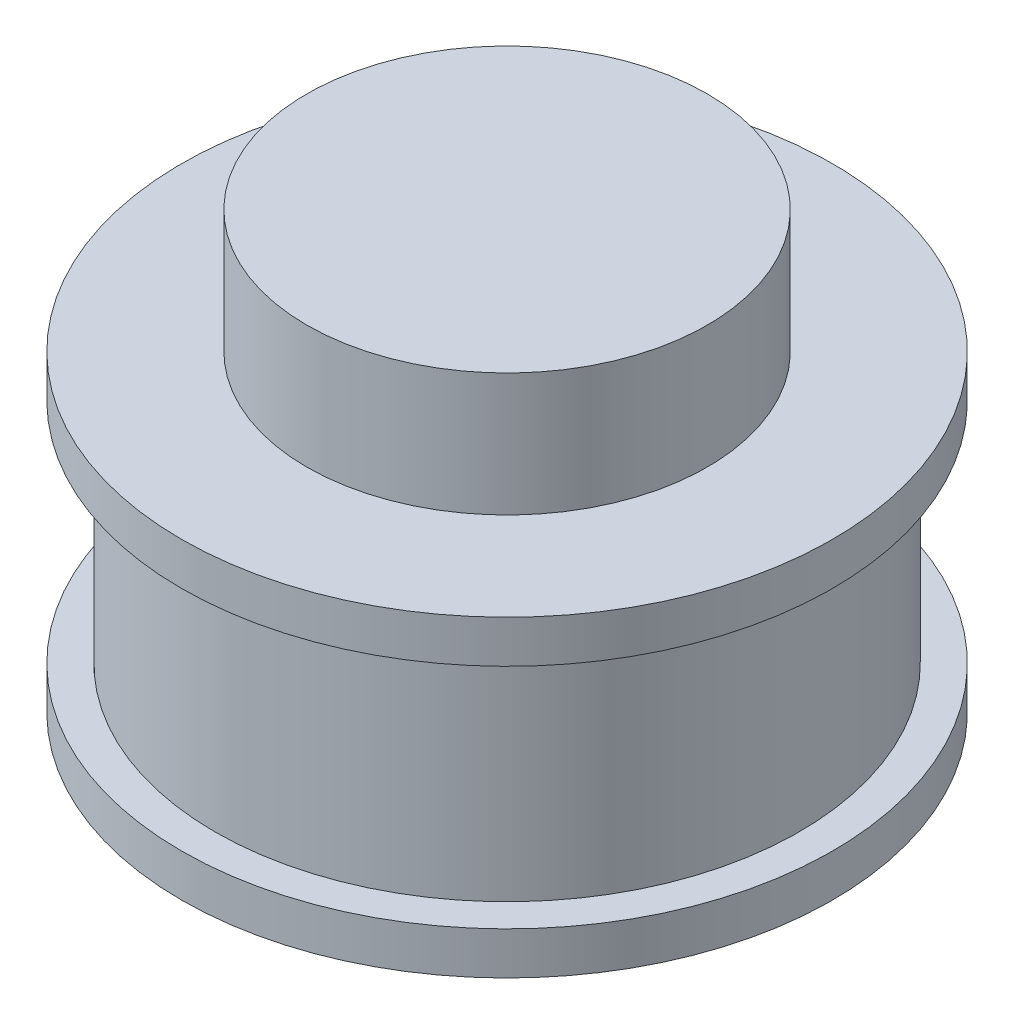
ISO-10303-21;
HEADER;
FILE_DESCRIPTION(('STEP AP214'),'2;1');
FILE_NAME('part.step','',(''),(''),'','','');
FILE_SCHEMA(('AUTOMOTIVE_DESIGN { 1 0 10303 214 1 1 1 1 }'));
ENDSEC;
DATA;
#1=APPLICATION_CONTEXT('core data for automotive mechanical design processes');
#2=APPLICATION_PROTOCOL_DEFINITION('international standard','automotive_design',2000,#1);
#3=PRODUCT_CONTEXT('',#1,'mechanical');
#4=PRODUCT('Part','Part','',(#3));
#5=PRODUCT_RELATED_PRODUCT_CATEGORY('part','',(#4));
#6=PRODUCT_DEFINITION_FORMATION('','',#4);
#7=PRODUCT_DEFINITION_CONTEXT('part definition',#1,'design');
#8=PRODUCT_DEFINITION('design','',#6,#7);
#9=PRODUCT_DEFINITION_SHAPE('','',#8);
#10=(LENGTH_UNIT() NAMED_UNIT(*) SI_UNIT(.MILLI.,.METRE.));
#11=(NAMED_UNIT(*) PLANE_ANGLE_UNIT() SI_UNIT($,.RADIAN.));
#12=(NAMED_UNIT(*) SI_UNIT($,.STERADIAN.) SOLID_ANGLE_UNIT());
#13=UNCERTAINTY_MEASURE_WITH_UNIT(LENGTH_MEASURE(1.E-05),#10,'distance_accuracy_value','');
#14=(GEOMETRIC_REPRESENTATION_CONTEXT(3) GLOBAL_UNCERTAINTY_ASSIGNED_CONTEXT((#13)) GLOBAL_UNIT_ASSIGNED_CONTEXT((#10,
#11,#12)) REPRESENTATION_CONTEXT('',''));
#15=CARTESIAN_POINT('',(0.,0.,0.));
#16=DIRECTION('',(0.,0.,1.));
#17=DIRECTION('',(1.,0.,0.));
#18=AXIS2_PLACEMENT_3D('',#15,#16,#17);
#19=CARTESIAN_POINT('',(0.,0.,0.));
#20=DIRECTION('',(0.,1.,0.));
#21=DIRECTION('',(0.,0.,1.));
#22=AXIS2_PLACEMENT_3D('',#19,#20,#21);
#23=PLANE('',#22);
#24=CARTESIAN_POINT('',(0.,0.,0.));
#25=DIRECTION('',(0.,1.,0.));
#26=DIRECTION('',(0.,0.,1.));
#27=AXIS2_PLACEMENT_3D('',#24,#25,#26);
#28=CIRCLE('',#27,20.6375);
#29=CARTESIAN_POINT('',(0.,0.,20.6375));
#30=VERTEX_POINT('',#29);
#31=EDGE_CURVE('E10',#30,#30,#28,.T.);
#32=ORIENTED_EDGE('',*,*,#31,.F.);
#33=EDGE_LOOP('',(#32));
#34=FACE_BOUND('',#33,.T.);
#35=ADVANCED_FACE('F31',(#34),#23,.F.);
#36=CARTESIAN_POINT('',(0.,27.6098,0.));
#37=DIRECTION('',(0.,1.,0.));
#38=DIRECTION('',(0.,0.,1.));
#39=AXIS2_PLACEMENT_3D('',#36,#37,#38);
#40=CYLINDRICAL_SURFACE('',#39,20.6375);
#41=CARTESIAN_POINT('',(0.,2.69732332820154,0.));
#42=DIRECTION('',(0.,1.,0.));
#43=DIRECTION('',(0.,0.,1.));
#44=AXIS2_PLACEMENT_3D('',#41,#42,#43);
#45=CIRCLE('',#44,20.6375);
#46=CARTESIAN_POINT('',(0.,2.69732332820154,20.6375));
#47=VERTEX_POINT('',#46);
#48=EDGE_CURVE('E37',#47,#47,#45,.T.);
#49=ORIENTED_EDGE('',*,*,#48,.F.);
#50=EDGE_LOOP('',(#49));
#51=FACE_BOUND('',#50,.T.);
#52=ORIENTED_EDGE('',*,*,#31,.T.);
#53=EDGE_LOOP('',(#52));
#54=FACE_BOUND('',#53,.T.);
#55=ADVANCED_FACE('F97',(#51,#54),#40,.T.);
#56=CARTESIAN_POINT('',(18.5293,2.69732332820154,0.));
#57=DIRECTION('',(0.,-1.,0.));
#58=DIRECTION('',(0.,0.,-1.));
#59=AXIS2_PLACEMENT_3D('',#56,#57,#58);
#60=PLANE('',#59);
#61=CARTESIAN_POINT('',(0.,2.69732332820154,0.));
#62=DIRECTION('',(0.,1.,0.));
#63=DIRECTION('',(0.,0.,1.));
#64=AXIS2_PLACEMENT_3D('',#61,#62,#63);
#65=CIRCLE('',#64,18.5293);
#66=CARTESIAN_POINT('',(0.,2.69732332820154,18.5293));
#67=VERTEX_POINT('',#66);
#68=EDGE_CURVE('E41',#67,#67,#65,.T.);
#69=ORIENTED_EDGE('',*,*,#68,.F.);
#70=EDGE_LOOP('',(#69));
#71=FACE_BOUND('',#70,.T.);
#72=ORIENTED_EDGE('',*,*,#48,.T.);
#73=EDGE_LOOP('',(#72));
#74=FACE_BOUND('',#73,.T.);
#75=ADVANCED_FACE('F92',(#71,#74),#60,.F.);
#76=CARTESIAN_POINT('',(0.,27.6098,0.));
#77=DIRECTION('',(0.,1.,0.));
#78=DIRECTION('',(0.,0.,1.));
#79=AXIS2_PLACEMENT_3D('',#76,#77,#78);
#80=CYLINDRICAL_SURFACE('',#79,18.5293);
#81=CARTESIAN_POINT('',(0.,17.1146766717985,0.));
#82=DIRECTION('',(0.,1.,0.));
#83=DIRECTION('',(0.,0.,1.));
#84=AXIS2_PLACEMENT_3D('',#81,#82,#83);
#85=CIRCLE('',#84,18.5293);
#86=CARTESIAN_POINT('',(0.,17.1146766717985,18.5293));
#87=VERTEX_POINT('',#86);
#88=EDGE_CURVE('E45',#87,#87,#85,.T.);
#89=ORIENTED_EDGE('',*,*,#88,.F.);
#90=EDGE_LOOP('',(#89));
#91=FACE_BOUND('',#90,.T.);
#92=ORIENTED_EDGE('',*,*,#68,.T.);
#93=EDGE_LOOP('',(#92));
#94=FACE_BOUND('',#93,.T.);
#95=ADVANCED_FACE('F86',(#91,#94),#80,.T.);
#96=CARTESIAN_POINT('',(18.5293,17.1146766717985,0.));
#97=DIRECTION('',(0.,1.,0.));
#98=DIRECTION('',(0.,0.,1.));
#99=AXIS2_PLACEMENT_3D('',#96,#97,#98);
#100=PLANE('',#99);
#101=CARTESIAN_POINT('',(0.,17.1146766717985,0.));
#102=DIRECTION('',(0.,1.,0.));
#103=DIRECTION('',(0.,0.,1.));
#104=AXIS2_PLACEMENT_3D('',#101,#102,#103);
#105=CIRCLE('',#104,20.6375);
#106=CARTESIAN_POINT('',(0.,17.1146766717985,20.6375));
#107=VERTEX_POINT('',#106);
#108=EDGE_CURVE('E50',#107,#107,#105,.T.);
#109=ORIENTED_EDGE('',*,*,#108,.F.);
#110=EDGE_LOOP('',(#109));
#111=FACE_BOUND('',#110,.T.);
#112=ORIENTED_EDGE('',*,*,#88,.T.);
#113=EDGE_LOOP('',(#112));
#114=FACE_BOUND('',#113,.T.);
#115=ADVANCED_FACE('F80',(#111,#114),#100,.F.);
#116=CARTESIAN_POINT('',(0.,27.6098,0.));
#117=DIRECTION('',(0.,1.,0.));
#118=DIRECTION('',(0.,0.,1.));
#119=AXIS2_PLACEMENT_3D('',#116,#117,#118);
#120=CYLINDRICAL_SURFACE('',#119,20.6375);
#121=CARTESIAN_POINT('',(0.,19.812,0.));
#122=DIRECTION('',(0.,1.,0.));
#123=DIRECTION('',(0.,0.,1.));
#124=AXIS2_PLACEMENT_3D('',#121,#122,#123);
#125=CIRCLE('',#124,20.6375);
#126=CARTESIAN_POINT('',(0.,19.812,20.6375));
#127=VERTEX_POINT('',#126);
#128=EDGE_CURVE('E53',#127,#127,#125,.T.);
#129=ORIENTED_EDGE('',*,*,#128,.F.);
#130=EDGE_LOOP('',(#129));
#131=FACE_BOUND('',#130,.T.);
#132=ORIENTED_EDGE('',*,*,#108,.T.);
#133=EDGE_LOOP('',(#132));
#134=FACE_BOUND('',#133,.T.);
#135=ADVANCED_FACE('F74',(#131,#134),#120,.T.);
#136=CARTESIAN_POINT('',(20.6375,19.812,0.));
#137=DIRECTION('',(0.,-1.,0.));
#138=DIRECTION('',(0.,0.,-1.));
#139=AXIS2_PLACEMENT_3D('',#136,#137,#138);
#140=PLANE('',#139);
#141=CARTESIAN_POINT('',(0.,19.812,0.));
#142=DIRECTION('',(0.,1.,0.));
#143=DIRECTION('',(0.,0.,1.));
#144=AXIS2_PLACEMENT_3D('',#141,#142,#143);
#145=CIRCLE('',#144,12.7);
#146=CARTESIAN_POINT('',(0.,19.812,12.7));
#147=VERTEX_POINT('',#146);
#148=EDGE_CURVE('E56',#147,#147,#145,.T.);
#149=ORIENTED_EDGE('',*,*,#148,.F.);
#150=EDGE_LOOP('',(#149));
#151=FACE_BOUND('',#150,.T.);
#152=ORIENTED_EDGE('',*,*,#128,.T.);
#153=EDGE_LOOP('',(#152));
#154=FACE_BOUND('',#153,.T.);
#155=ADVANCED_FACE('F68',(#151,#154),#140,.F.);
#156=CARTESIAN_POINT('',(0.,27.6098,0.));
#157=DIRECTION('',(0.,1.,0.));
#158=DIRECTION('',(0.,0.,1.));
#159=AXIS2_PLACEMENT_3D('',#156,#157,#158);
#160=CYLINDRICAL_SURFACE('',#159,12.7);
#161=CARTESIAN_POINT('',(0.,27.6098,0.));
#162=DIRECTION('',(0.,1.,0.));
#163=DIRECTION('',(0.,0.,1.));
#164=AXIS2_PLACEMENT_3D('',#161,#162,#163);
#165=CIRCLE('',#164,12.7);
#166=CARTESIAN_POINT('',(0.,27.6098,12.7));
#167=VERTEX_POINT('',#166);
#168=EDGE_CURVE('E59',#167,#167,#165,.T.);
#169=ORIENTED_EDGE('',*,*,#168,.F.);
#170=EDGE_LOOP('',(#169));
#171=FACE_BOUND('',#170,.T.);
#172=ORIENTED_EDGE('',*,*,#148,.T.);
#173=EDGE_LOOP('',(#172));
#174=FACE_BOUND('',#173,.T.);
#175=ADVANCED_FACE('F65',(#171,#174),#160,.T.);
#176=CARTESIAN_POINT('',(0.,27.6098,0.));
#177=DIRECTION('',(0.,-1.,0.));
#178=DIRECTION('',(0.,0.,-1.));
#179=AXIS2_PLACEMENT_3D('',#176,#177,#178);
#180=PLANE('',#179);
#181=ORIENTED_EDGE('',*,*,#168,.T.);
#182=EDGE_LOOP('',(#181));
#183=FACE_BOUND('',#182,.T.);
#184=ADVANCED_FACE('F63',(#183),#180,.F.);
#185=CLOSED_SHELL('',(#35,#55,#75,#95,#115,#135,#155,#175,#184));
#186=MANIFOLD_SOLID_BREP('B2',#185);
#187=ADVANCED_BREP_SHAPE_REPRESENTATION('',(#18,#186),#14);
#188=SHAPE_DEFINITION_REPRESENTATION(#9,#187);
ENDSEC;
END-ISO-10303-21;
